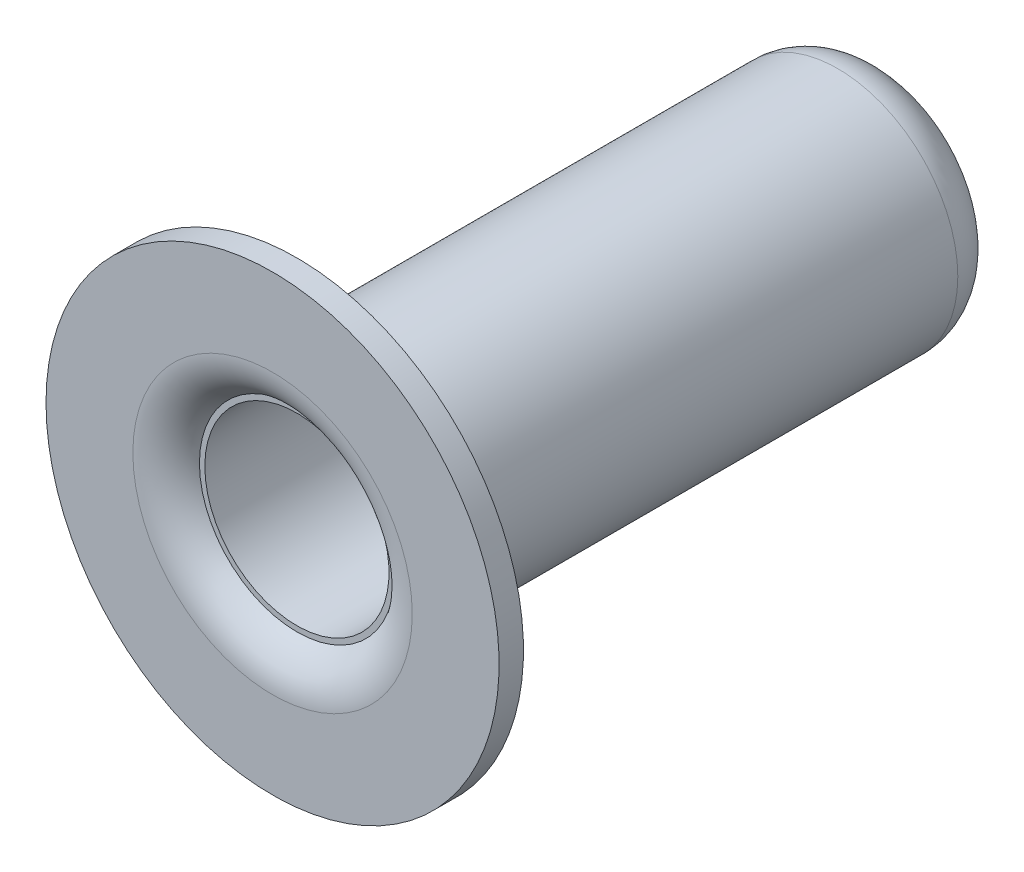
ISO-10303-21;
HEADER;
FILE_DESCRIPTION(('STEP AP214'),'2;1');
FILE_NAME('part.step','',(''),(''),'','','');
FILE_SCHEMA(('AUTOMOTIVE_DESIGN { 1 0 10303 214 1 1 1 1 }'));
ENDSEC;
DATA;
#1=APPLICATION_CONTEXT('core data for automotive mechanical design processes');
#2=APPLICATION_PROTOCOL_DEFINITION('international standard','automotive_design',2000,#1);
#3=PRODUCT_CONTEXT('',#1,'mechanical');
#4=PRODUCT('Part','Part','',(#3));
#5=PRODUCT_RELATED_PRODUCT_CATEGORY('part','',(#4));
#6=PRODUCT_DEFINITION_FORMATION('','',#4);
#7=PRODUCT_DEFINITION_CONTEXT('part definition',#1,'design');
#8=PRODUCT_DEFINITION('design','',#6,#7);
#9=PRODUCT_DEFINITION_SHAPE('','',#8);
#10=(LENGTH_UNIT() NAMED_UNIT(*) SI_UNIT(.MILLI.,.METRE.));
#11=(NAMED_UNIT(*) PLANE_ANGLE_UNIT() SI_UNIT($,.RADIAN.));
#12=(NAMED_UNIT(*) SI_UNIT($,.STERADIAN.) SOLID_ANGLE_UNIT());
#13=UNCERTAINTY_MEASURE_WITH_UNIT(LENGTH_MEASURE(1.E-05),#10,'distance_accuracy_value','');
#14=(GEOMETRIC_REPRESENTATION_CONTEXT(3) GLOBAL_UNCERTAINTY_ASSIGNED_CONTEXT((#13)) GLOBAL_UNIT_ASSIGNED_CONTEXT((#10,
#11,#12)) REPRESENTATION_CONTEXT('',''));
#15=CARTESIAN_POINT('',(0.,0.,0.));
#16=DIRECTION('',(0.,0.,1.));
#17=DIRECTION('',(1.,0.,0.));
#18=AXIS2_PLACEMENT_3D('',#15,#16,#17);
#19=CARTESIAN_POINT('',(0.,0.,5.159375));
#20=DIRECTION('',(0.,0.,1.));
#21=DIRECTION('',(1.,0.,0.));
#22=AXIS2_PLACEMENT_3D('',#19,#20,#21);
#23=PLANE('',#22);
#24=CARTESIAN_POINT('',(0.,0.,5.159375));
#25=DIRECTION('',(0.,0.,-1.));
#26=DIRECTION('',(-1.,0.,0.));
#27=AXIS2_PLACEMENT_3D('',#24,#25,#26);
#28=CIRCLE('',#27,3.68935);
#29=CARTESIAN_POINT('',(-3.68935,0.,5.159375));
#30=VERTEX_POINT('',#29);
#31=EDGE_CURVE('E55',#30,#30,#28,.T.);
#32=ORIENTED_EDGE('',*,*,#31,.F.);
#33=EDGE_LOOP('',(#32));
#34=FACE_BOUND('',#33,.T.);
#35=CARTESIAN_POINT('',(0.,0.,5.159375));
#36=DIRECTION('',(0.,0.,1.));
#37=DIRECTION('',(-1.,0.,0.));
#38=AXIS2_PLACEMENT_3D('',#35,#36,#37);
#39=CIRCLE('',#38,2.2749076642539);
#40=CARTESIAN_POINT('',(-2.2749076642539,0.,5.159375));
#41=VERTEX_POINT('',#40);
#42=CARTESIAN_POINT('',(2.2749076642539,0.,5.159375));
#43=VERTEX_POINT('',#42);
#44=EDGE_CURVE('E48',#41,#43,#39,.T.);
#45=ORIENTED_EDGE('',*,*,#44,.F.);
#46=CARTESIAN_POINT('',(0.,0.,5.159375));
#47=DIRECTION('',(0.,0.,1.));
#48=DIRECTION('',(1.,0.,0.));
#49=AXIS2_PLACEMENT_3D('',#46,#47,#48);
#50=CIRCLE('',#49,2.2749076642539);
#51=EDGE_CURVE('E45',#43,#41,#50,.T.);
#52=ORIENTED_EDGE('',*,*,#51,.F.);
#53=EDGE_LOOP('',(#45,#52));
#54=FACE_BOUND('',#53,.T.);
#55=ADVANCED_FACE('F17',(#34,#54),#23,.T.);
#56=CARTESIAN_POINT('',(0.,0.,4.365625));
#57=DIRECTION('',(0.,0.,1.));
#58=DIRECTION('',(1.,0.,0.));
#59=AXIS2_PLACEMENT_3D('',#56,#57,#58);
#60=TOROIDAL_SURFACE('',#59,2.2749076642539,0.79375);
#61=CARTESIAN_POINT('',(0.,0.,4.7625));
#62=DIRECTION('',(0.,0.,1.));
#63=DIRECTION('',(1.,0.,0.));
#64=AXIS2_PLACEMENT_3D('',#61,#62,#63);
#65=CIRCLE('',#64,1.5875);
#66=CARTESIAN_POINT('',(1.5875,0.,4.7625));
#67=VERTEX_POINT('',#66);
#68=EDGE_CURVE('E168',#67,#67,#65,.T.);
#69=ORIENTED_EDGE('',*,*,#68,.F.);
#70=EDGE_LOOP('',(#69));
#71=FACE_BOUND('',#70,.T.);
#72=ORIENTED_EDGE('',*,*,#51,.T.);
#73=ORIENTED_EDGE('',*,*,#44,.T.);
#74=EDGE_LOOP('',(#72,#73));
#75=FACE_BOUND('',#74,.T.);
#76=ADVANCED_FACE('F54',(#71,#75),#60,.T.);
#77=CARTESIAN_POINT('',(0.,0.,5.159375));
#78=DIRECTION('',(0.,0.,-1.));
#79=DIRECTION('',(-1.,0.,0.));
#80=AXIS2_PLACEMENT_3D('',#77,#78,#79);
#81=CYLINDRICAL_SURFACE('',#80,3.68935);
#82=ORIENTED_EDGE('',*,*,#31,.T.);
#83=EDGE_LOOP('',(#82));
#84=FACE_BOUND('',#83,.T.);
#85=CARTESIAN_POINT('',(0.,0.,4.7625));
#86=DIRECTION('',(0.,0.,-1.));
#87=DIRECTION('',(-1.,0.,0.));
#88=AXIS2_PLACEMENT_3D('',#85,#86,#87);
#89=CIRCLE('',#88,3.68935);
#90=CARTESIAN_POINT('',(-3.68935,0.,4.7625));
#91=VERTEX_POINT('',#90);
#92=EDGE_CURVE('E166',#91,#91,#89,.F.);
#93=ORIENTED_EDGE('',*,*,#92,.T.);
#94=EDGE_LOOP('',(#93));
#95=FACE_BOUND('',#94,.T.);
#96=ADVANCED_FACE('F73',(#84,#95),#81,.T.);
#97=CARTESIAN_POINT('',(0.,0.,4.7625));
#98=DIRECTION('',(0.,0.,1.));
#99=DIRECTION('',(1.,0.,0.));
#100=AXIS2_PLACEMENT_3D('',#97,#98,#99);
#101=PLANE('',#100);
#102=CARTESIAN_POINT('',(0.,0.,4.7625));
#103=DIRECTION('',(0.,0.,-1.));
#104=DIRECTION('',(-1.,0.,0.));
#105=AXIS2_PLACEMENT_3D('',#102,#103,#104);
#106=CIRCLE('',#105,1.5);
#107=CARTESIAN_POINT('',(-1.5,0.,4.7625));
#108=VERTEX_POINT('',#107);
#109=EDGE_CURVE('E63',#108,#108,#106,.T.);
#110=ORIENTED_EDGE('',*,*,#109,.T.);
#111=EDGE_LOOP('',(#110));
#112=FACE_BOUND('',#111,.T.);
#113=ORIENTED_EDGE('',*,*,#68,.T.);
#114=EDGE_LOOP('',(#113));
#115=FACE_BOUND('',#114,.T.);
#116=ADVANCED_FACE('F126',(#112,#115),#101,.T.);
#117=CARTESIAN_POINT('',(0.,0.,4.7625));
#118=DIRECTION('',(0.,0.,1.));
#119=DIRECTION('',(1.,0.,0.));
#120=AXIS2_PLACEMENT_3D('',#117,#118,#119);
#121=PLANE('',#120);
#122=ORIENTED_EDGE('',*,*,#92,.F.);
#123=EDGE_LOOP('',(#122));
#124=FACE_BOUND('',#123,.T.);
#125=CARTESIAN_POINT('',(0.,0.,4.7625));
#126=DIRECTION('',(0.,0.,-1.));
#127=DIRECTION('',(1.,0.,0.));
#128=AXIS2_PLACEMENT_3D('',#125,#126,#127);
#129=CIRCLE('',#128,2.74955);
#130=CARTESIAN_POINT('',(-2.74955,0.,4.7625));
#131=VERTEX_POINT('',#130);
#132=CARTESIAN_POINT('',(2.74955,0.,4.7625));
#133=VERTEX_POINT('',#132);
#134=EDGE_CURVE('E115',#131,#133,#129,.F.);
#135=ORIENTED_EDGE('',*,*,#134,.T.);
#136=CARTESIAN_POINT('',(0.,0.,4.7625));
#137=DIRECTION('',(0.,0.,-1.));
#138=DIRECTION('',(-1.,0.,0.));
#139=AXIS2_PLACEMENT_3D('',#136,#137,#138);
#140=CIRCLE('',#139,2.74955);
#141=EDGE_CURVE('E36',#133,#131,#140,.F.);
#142=ORIENTED_EDGE('',*,*,#141,.T.);
#143=EDGE_LOOP('',(#135,#142));
#144=FACE_BOUND('',#143,.T.);
#145=ADVANCED_FACE('F118',(#124,#144),#121,.F.);
#146=CARTESIAN_POINT('',(0.,0.,4.7625));
#147=DIRECTION('',(0.,0.,-1.));
#148=DIRECTION('',(-1.,0.,0.));
#149=AXIS2_PLACEMENT_3D('',#146,#147,#148);
#150=CYLINDRICAL_SURFACE('',#149,1.5);
#151=ORIENTED_EDGE('',*,*,#109,.F.);
#152=EDGE_LOOP('',(#151));
#153=FACE_BOUND('',#152,.T.);
#154=CARTESIAN_POINT('',(0.,0.,-4.7625));
#155=DIRECTION('',(0.,0.,-1.));
#156=DIRECTION('',(-1.,0.,0.));
#157=AXIS2_PLACEMENT_3D('',#154,#155,#156);
#158=CIRCLE('',#157,1.5);
#159=CARTESIAN_POINT('',(-1.5,0.,-4.7625));
#160=VERTEX_POINT('',#159);
#161=EDGE_CURVE('E81',#160,#160,#158,.F.);
#162=ORIENTED_EDGE('',*,*,#161,.F.);
#163=EDGE_LOOP('',(#162));
#164=FACE_BOUND('',#163,.T.);
#165=ADVANCED_FACE('F105',(#153,#164),#150,.F.);
#166=CARTESIAN_POINT('',(0.,0.,3.96875));
#167=DIRECTION('',(0.,0.,1.));
#168=DIRECTION('',(1.,0.,0.));
#169=AXIS2_PLACEMENT_3D('',#166,#167,#168);
#170=TOROIDAL_SURFACE('',#169,2.74955,0.79375);
#171=ORIENTED_EDGE('',*,*,#141,.F.);
#172=ORIENTED_EDGE('',*,*,#134,.F.);
#173=EDGE_LOOP('',(#171,#172));
#174=FACE_BOUND('',#173,.T.);
#175=CARTESIAN_POINT('',(0.,0.,3.96875));
#176=DIRECTION('',(0.,0.,-1.));
#177=DIRECTION('',(-1.,0.,0.));
#178=AXIS2_PLACEMENT_3D('',#175,#176,#177);
#179=CIRCLE('',#178,1.9558);
#180=CARTESIAN_POINT('',(-1.9558,0.,3.96875));
#181=VERTEX_POINT('',#180);
#182=EDGE_CURVE('E28',#181,#181,#179,.T.);
#183=ORIENTED_EDGE('',*,*,#182,.F.);
#184=EDGE_LOOP('',(#183));
#185=FACE_BOUND('',#184,.T.);
#186=ADVANCED_FACE('F93',(#174,#185),#170,.F.);
#187=CARTESIAN_POINT('',(0.,0.,-4.0442877333267));
#188=DIRECTION('',(0.,0.,-1.));
#189=DIRECTION('',(-1.,0.,0.));
#190=AXIS2_PLACEMENT_3D('',#187,#188,#189);
#191=TOROIDAL_SURFACE('',#190,1.16205,0.79375);
#192=ORIENTED_EDGE('',*,*,#161,.T.);
#193=EDGE_LOOP('',(#192));
#194=FACE_BOUND('',#193,.T.);
#195=CARTESIAN_POINT('',(0.,0.,-4.0442877333267));
#196=DIRECTION('',(0.,0.,-1.));
#197=DIRECTION('',(-1.,0.,0.));
#198=AXIS2_PLACEMENT_3D('',#195,#196,#197);
#199=CIRCLE('',#198,1.9558);
#200=CARTESIAN_POINT('',(-1.9558,0.,-4.0442877333267));
#201=VERTEX_POINT('',#200);
#202=EDGE_CURVE('E11',#201,#201,#199,.F.);
#203=ORIENTED_EDGE('',*,*,#202,.F.);
#204=EDGE_LOOP('',(#203));
#205=FACE_BOUND('',#204,.T.);
#206=ADVANCED_FACE('F104',(#194,#205),#191,.T.);
#207=CARTESIAN_POINT('',(0.,0.,4.7625));
#208=DIRECTION('',(0.,0.,-1.));
#209=DIRECTION('',(-1.,0.,0.));
#210=AXIS2_PLACEMENT_3D('',#207,#208,#209);
#211=CYLINDRICAL_SURFACE('',#210,1.9558);
#212=ORIENTED_EDGE('',*,*,#202,.T.);
#213=EDGE_LOOP('',(#212));
#214=FACE_BOUND('',#213,.T.);
#215=ORIENTED_EDGE('',*,*,#182,.T.);
#216=EDGE_LOOP('',(#215));
#217=FACE_BOUND('',#216,.T.);
#218=ADVANCED_FACE('F145',(#214,#217),#211,.T.);
#219=CLOSED_SHELL('',(#55,#76,#96,#116,#145,#165,#186,#206,#218));
#220=MANIFOLD_SOLID_BREP('B1',#219);
#221=ADVANCED_BREP_SHAPE_REPRESENTATION('',(#18,#220),#14);
#222=SHAPE_DEFINITION_REPRESENTATION(#9,#221);
ENDSEC;
END-ISO-10303-21;
